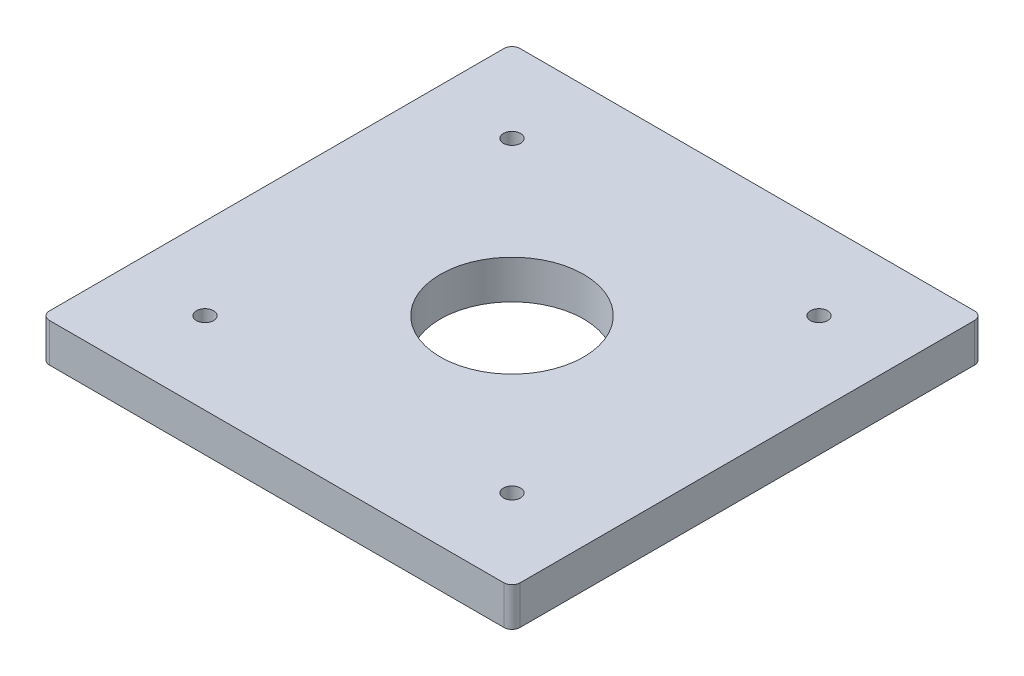
ISO-10303-21;
HEADER;
FILE_DESCRIPTION(('STEP AP214'),'2;1');
FILE_NAME('part.step','',(''),(''),'','','');
FILE_SCHEMA(('AUTOMOTIVE_DESIGN { 1 0 10303 214 1 1 1 1 }'));
ENDSEC;
DATA;
#1=APPLICATION_CONTEXT('core data for automotive mechanical design processes');
#2=APPLICATION_PROTOCOL_DEFINITION('international standard','automotive_design',2000,#1);
#3=PRODUCT_CONTEXT('',#1,'mechanical');
#4=PRODUCT('Part','Part','',(#3));
#5=PRODUCT_RELATED_PRODUCT_CATEGORY('part','',(#4));
#6=PRODUCT_DEFINITION_FORMATION('','',#4);
#7=PRODUCT_DEFINITION_CONTEXT('part definition',#1,'design');
#8=PRODUCT_DEFINITION('design','',#6,#7);
#9=PRODUCT_DEFINITION_SHAPE('','',#8);
#10=(LENGTH_UNIT() NAMED_UNIT(*) SI_UNIT(.MILLI.,.METRE.));
#11=(NAMED_UNIT(*) PLANE_ANGLE_UNIT() SI_UNIT($,.RADIAN.));
#12=(NAMED_UNIT(*) SI_UNIT($,.STERADIAN.) SOLID_ANGLE_UNIT());
#13=UNCERTAINTY_MEASURE_WITH_UNIT(LENGTH_MEASURE(1.E-05),#10,'distance_accuracy_value','');
#14=(GEOMETRIC_REPRESENTATION_CONTEXT(3) GLOBAL_UNCERTAINTY_ASSIGNED_CONTEXT((#13)) GLOBAL_UNIT_ASSIGNED_CONTEXT((#10,
#11,#12)) REPRESENTATION_CONTEXT('',''));
#15=CARTESIAN_POINT('',(0.,0.,0.));
#16=DIRECTION('',(0.,0.,1.));
#17=DIRECTION('',(1.,0.,0.));
#18=AXIS2_PLACEMENT_3D('',#15,#16,#17);
#19=CARTESIAN_POINT('',(0.,0.,0.));
#20=DIRECTION('',(0.,1.,0.));
#21=DIRECTION('',(0.,0.,1.));
#22=AXIS2_PLACEMENT_3D('',#19,#20,#21);
#23=PLANE('',#22);
#24=CARTESIAN_POINT('',(-47.625,0.,47.6249999999999));
#25=DIRECTION('',(0.,1.,0.));
#26=DIRECTION('',(0.,0.,1.));
#27=AXIS2_PLACEMENT_3D('',#24,#25,#26);
#28=CIRCLE('',#27,2.667);
#29=CARTESIAN_POINT('',(-47.625,0.,50.2919999999999));
#30=VERTEX_POINT('',#29);
#31=EDGE_CURVE('E144',#30,#30,#28,.T.);
#32=ORIENTED_EDGE('',*,*,#31,.T.);
#33=EDGE_LOOP('',(#32));
#34=FACE_BOUND('',#33,.T.);
#35=CARTESIAN_POINT('',(47.6249999999999,0.,-47.6250000000001));
#36=DIRECTION('',(0.,1.,0.));
#37=DIRECTION('',(0.,0.,1.));
#38=AXIS2_PLACEMENT_3D('',#35,#36,#37);
#39=CIRCLE('',#38,2.667);
#40=CARTESIAN_POINT('',(47.6249999999999,0.,-44.9580000000001));
#41=VERTEX_POINT('',#40);
#42=EDGE_CURVE('E147',#41,#41,#39,.T.);
#43=ORIENTED_EDGE('',*,*,#42,.T.);
#44=EDGE_LOOP('',(#43));
#45=FACE_BOUND('',#44,.T.);
#46=CARTESIAN_POINT('',(0.,0.,0.));
#47=DIRECTION('',(0.,-1.,0.));
#48=DIRECTION('',(0.,0.,-1.));
#49=AXIS2_PLACEMENT_3D('',#46,#47,#48);
#50=CIRCLE('',#49,22.225);
#51=CARTESIAN_POINT('',(0.,0.,-22.225));
#52=VERTEX_POINT('',#51);
#53=EDGE_CURVE('E150',#52,#52,#50,.F.);
#54=ORIENTED_EDGE('',*,*,#53,.T.);
#55=EDGE_LOOP('',(#54));
#56=FACE_BOUND('',#55,.T.);
#57=CARTESIAN_POINT('',(-70.485,0.,-70.485));
#58=DIRECTION('',(0.,-1.,0.));
#59=DIRECTION('',(0.,0.,-1.));
#60=AXIS2_PLACEMENT_3D('',#57,#58,#59);
#61=CIRCLE('',#60,2.54);
#62=CARTESIAN_POINT('',(-70.485,0.,-73.025));
#63=VERTEX_POINT('',#62);
#64=CARTESIAN_POINT('',(-73.025,0.,-70.485));
#65=VERTEX_POINT('',#64);
#66=EDGE_CURVE('E85',#63,#65,#61,.F.);
#67=ORIENTED_EDGE('',*,*,#66,.F.);
#68=DIRECTION('',(1.,0.,0.));
#69=VECTOR('',#68,1.);
#70=CARTESIAN_POINT('',(73.025,0.,-73.025));
#71=LINE('',#70,#69);
#72=CARTESIAN_POINT('',(70.485,0.,-73.025));
#73=VERTEX_POINT('',#72);
#74=EDGE_CURVE('E77',#63,#73,#71,.T.);
#75=ORIENTED_EDGE('',*,*,#74,.T.);
#76=CARTESIAN_POINT('',(70.485,0.,-70.485));
#77=DIRECTION('',(0.,-1.,0.));
#78=DIRECTION('',(0.,0.,-1.));
#79=AXIS2_PLACEMENT_3D('',#76,#77,#78);
#80=CIRCLE('',#79,2.54);
#81=CARTESIAN_POINT('',(73.025,0.,-70.485));
#82=VERTEX_POINT('',#81);
#83=EDGE_CURVE('E154',#82,#73,#80,.F.);
#84=ORIENTED_EDGE('',*,*,#83,.F.);
#85=DIRECTION('',(0.,0.,1.));
#86=VECTOR('',#85,1.);
#87=CARTESIAN_POINT('',(73.025,0.,73.025));
#88=LINE('',#87,#86);
#89=CARTESIAN_POINT('',(73.025,0.,70.485));
#90=VERTEX_POINT('',#89);
#91=EDGE_CURVE('E112',#82,#90,#88,.T.);
#92=ORIENTED_EDGE('',*,*,#91,.T.);
#93=CARTESIAN_POINT('',(70.485,0.,70.485));
#94=DIRECTION('',(0.,-1.,0.));
#95=DIRECTION('',(0.,0.,-1.));
#96=AXIS2_PLACEMENT_3D('',#93,#94,#95);
#97=CIRCLE('',#96,2.54);
#98=CARTESIAN_POINT('',(70.485,0.,73.025));
#99=VERTEX_POINT('',#98);
#100=EDGE_CURVE('E157',#99,#90,#97,.F.);
#101=ORIENTED_EDGE('',*,*,#100,.F.);
#102=DIRECTION('',(-1.,0.,0.));
#103=VECTOR('',#102,1.);
#104=CARTESIAN_POINT('',(73.025,0.,73.025));
#105=LINE('',#104,#103);
#106=CARTESIAN_POINT('',(-70.485,0.,73.025));
#107=VERTEX_POINT('',#106);
#108=EDGE_CURVE('E116',#99,#107,#105,.T.);
#109=ORIENTED_EDGE('',*,*,#108,.T.);
#110=CARTESIAN_POINT('',(-70.485,0.,70.485));
#111=DIRECTION('',(0.,-1.,0.));
#112=DIRECTION('',(0.,0.,-1.));
#113=AXIS2_PLACEMENT_3D('',#110,#111,#112);
#114=CIRCLE('',#113,2.54);
#115=CARTESIAN_POINT('',(-73.025,0.,70.485));
#116=VERTEX_POINT('',#115);
#117=EDGE_CURVE('E88',#116,#107,#114,.F.);
#118=ORIENTED_EDGE('',*,*,#117,.F.);
#119=DIRECTION('',(0.,0.,-1.));
#120=VECTOR('',#119,1.);
#121=CARTESIAN_POINT('',(-73.025,0.,73.025));
#122=LINE('',#121,#120);
#123=EDGE_CURVE('E82',#116,#65,#122,.T.);
#124=ORIENTED_EDGE('',*,*,#123,.T.);
#125=EDGE_LOOP('',(#67,#75,#84,#92,#101,#109,#118,#124));
#126=FACE_BOUND('',#125,.T.);
#127=CARTESIAN_POINT('',(-47.6250000000001,0.,-47.6250000000001));
#128=DIRECTION('',(0.,1.,0.));
#129=DIRECTION('',(0.,0.,1.));
#130=AXIS2_PLACEMENT_3D('',#127,#128,#129);
#131=CIRCLE('',#130,2.667);
#132=CARTESIAN_POINT('',(-47.6250000000001,0.,-44.9580000000001));
#133=VERTEX_POINT('',#132);
#134=EDGE_CURVE('E111',#133,#133,#131,.T.);
#135=ORIENTED_EDGE('',*,*,#134,.T.);
#136=EDGE_LOOP('',(#135));
#137=FACE_BOUND('',#136,.T.);
#138=CARTESIAN_POINT('',(47.625,0.,47.6249999999999));
#139=DIRECTION('',(0.,1.,0.));
#140=DIRECTION('',(0.,0.,1.));
#141=AXIS2_PLACEMENT_3D('',#138,#139,#140);
#142=CIRCLE('',#141,2.667);
#143=CARTESIAN_POINT('',(47.625,0.,50.2919999999999));
#144=VERTEX_POINT('',#143);
#145=EDGE_CURVE('E19',#144,#144,#142,.T.);
#146=ORIENTED_EDGE('',*,*,#145,.T.);
#147=EDGE_LOOP('',(#146));
#148=FACE_BOUND('',#147,.T.);
#149=ADVANCED_FACE('F16',(#34,#45,#56,#126,#137,#148),#23,.F.);
#150=CARTESIAN_POINT('',(47.625,0.,47.6249999999999));
#151=DIRECTION('',(0.,1.,0.));
#152=DIRECTION('',(0.,0.,1.));
#153=AXIS2_PLACEMENT_3D('',#150,#151,#152);
#154=CYLINDRICAL_SURFACE('',#153,2.667);
#155=ORIENTED_EDGE('',*,*,#145,.F.);
#156=EDGE_LOOP('',(#155));
#157=FACE_BOUND('',#156,.T.);
#158=CARTESIAN_POINT('',(47.625,12.,47.6249999999999));
#159=DIRECTION('',(0.,1.,0.));
#160=DIRECTION('',(0.,0.,1.));
#161=AXIS2_PLACEMENT_3D('',#158,#159,#160);
#162=CIRCLE('',#161,2.667);
#163=CARTESIAN_POINT('',(47.625,12.,50.2919999999999));
#164=VERTEX_POINT('',#163);
#165=EDGE_CURVE('E141',#164,#164,#162,.F.);
#166=ORIENTED_EDGE('',*,*,#165,.F.);
#167=EDGE_LOOP('',(#166));
#168=FACE_BOUND('',#167,.T.);
#169=ADVANCED_FACE('F166',(#157,#168),#154,.F.);
#170=CARTESIAN_POINT('',(-47.6250000000001,0.,-47.6250000000001));
#171=DIRECTION('',(0.,1.,0.));
#172=DIRECTION('',(0.,0.,1.));
#173=AXIS2_PLACEMENT_3D('',#170,#171,#172);
#174=CYLINDRICAL_SURFACE('',#173,2.667);
#175=ORIENTED_EDGE('',*,*,#134,.F.);
#176=EDGE_LOOP('',(#175));
#177=FACE_BOUND('',#176,.T.);
#178=CARTESIAN_POINT('',(-47.6250000000001,12.,-47.6250000000001));
#179=DIRECTION('',(0.,1.,0.));
#180=DIRECTION('',(0.,0.,1.));
#181=AXIS2_PLACEMENT_3D('',#178,#179,#180);
#182=CIRCLE('',#181,2.667);
#183=CARTESIAN_POINT('',(-47.6250000000001,12.,-44.9580000000001));
#184=VERTEX_POINT('',#183);
#185=EDGE_CURVE('E138',#184,#184,#182,.F.);
#186=ORIENTED_EDGE('',*,*,#185,.F.);
#187=EDGE_LOOP('',(#186));
#188=FACE_BOUND('',#187,.T.);
#189=ADVANCED_FACE('F169',(#177,#188),#174,.F.);
#190=CARTESIAN_POINT('',(73.025,12.,-73.025));
#191=DIRECTION('',(0.,0.,1.));
#192=DIRECTION('',(1.,0.,0.));
#193=AXIS2_PLACEMENT_3D('',#190,#191,#192);
#194=PLANE('',#193);
#195=DIRECTION('',(0.,-1.,0.));
#196=VECTOR('',#195,1.);
#197=CARTESIAN_POINT('',(-70.485,12.,-73.025));
#198=LINE('',#197,#196);
#199=CARTESIAN_POINT('',(-70.485,12.,-73.025));
#200=VERTEX_POINT('',#199);
#201=EDGE_CURVE('E98',#200,#63,#198,.T.);
#202=ORIENTED_EDGE('',*,*,#201,.F.);
#203=DIRECTION('',(1.,0.,0.));
#204=VECTOR('',#203,1.);
#205=CARTESIAN_POINT('',(0.,12.,-73.025));
#206=LINE('',#205,#204);
#207=CARTESIAN_POINT('',(70.485,12.,-73.025));
#208=VERTEX_POINT('',#207);
#209=EDGE_CURVE('E137',#208,#200,#206,.F.);
#210=ORIENTED_EDGE('',*,*,#209,.F.);
#211=DIRECTION('',(0.,-1.,0.));
#212=VECTOR('',#211,1.);
#213=CARTESIAN_POINT('',(70.485,12.,-73.025));
#214=LINE('',#213,#212);
#215=EDGE_CURVE('E153',#73,#208,#214,.F.);
#216=ORIENTED_EDGE('',*,*,#215,.F.);
#217=ORIENTED_EDGE('',*,*,#74,.F.);
#218=EDGE_LOOP('',(#202,#210,#216,#217));
#219=FACE_BOUND('',#218,.T.);
#220=ADVANCED_FACE('F216',(#219),#194,.F.);
#221=CARTESIAN_POINT('',(-70.485,12.,-70.485));
#222=DIRECTION('',(0.,-1.,0.));
#223=DIRECTION('',(0.,0.,-1.));
#224=AXIS2_PLACEMENT_3D('',#221,#222,#223);
#225=CYLINDRICAL_SURFACE('',#224,2.54);
#226=ORIENTED_EDGE('',*,*,#66,.T.);
#227=DIRECTION('',(0.,1.,0.));
#228=VECTOR('',#227,1.);
#229=CARTESIAN_POINT('',(-73.025,12.,-70.485));
#230=LINE('',#229,#228);
#231=CARTESIAN_POINT('',(-73.025,12.,-70.485));
#232=VERTEX_POINT('',#231);
#233=EDGE_CURVE('E92',#65,#232,#230,.T.);
#234=ORIENTED_EDGE('',*,*,#233,.T.);
#235=CARTESIAN_POINT('',(-70.485,12.,-70.485));
#236=DIRECTION('',(0.,-1.,0.));
#237=DIRECTION('',(0.,0.,-1.));
#238=AXIS2_PLACEMENT_3D('',#235,#236,#237);
#239=CIRCLE('',#238,2.54);
#240=EDGE_CURVE('E135',#200,#232,#239,.F.);
#241=ORIENTED_EDGE('',*,*,#240,.F.);
#242=ORIENTED_EDGE('',*,*,#201,.T.);
#243=EDGE_LOOP('',(#226,#234,#241,#242));
#244=FACE_BOUND('',#243,.T.);
#245=ADVANCED_FACE('F95',(#244),#225,.T.);
#246=CARTESIAN_POINT('',(-73.025,12.,73.025));
#247=DIRECTION('',(1.,0.,0.));
#248=DIRECTION('',(0.,0.,-1.));
#249=AXIS2_PLACEMENT_3D('',#246,#247,#248);
#250=PLANE('',#249);
#251=ORIENTED_EDGE('',*,*,#233,.F.);
#252=ORIENTED_EDGE('',*,*,#123,.F.);
#253=DIRECTION('',(0.,-1.,0.));
#254=VECTOR('',#253,1.);
#255=CARTESIAN_POINT('',(-73.025,12.,70.485));
#256=LINE('',#255,#254);
#257=CARTESIAN_POINT('',(-73.025,12.,70.485));
#258=VERTEX_POINT('',#257);
#259=EDGE_CURVE('E104',#258,#116,#256,.T.);
#260=ORIENTED_EDGE('',*,*,#259,.F.);
#261=DIRECTION('',(0.,0.,1.));
#262=VECTOR('',#261,1.);
#263=CARTESIAN_POINT('',(-73.025,12.,0.));
#264=LINE('',#263,#262);
#265=EDGE_CURVE('E102',#232,#258,#264,.T.);
#266=ORIENTED_EDGE('',*,*,#265,.F.);
#267=EDGE_LOOP('',(#251,#252,#260,#266));
#268=FACE_BOUND('',#267,.T.);
#269=ADVANCED_FACE('F100',(#268),#250,.F.);
#270=CARTESIAN_POINT('',(-70.485,12.,70.485));
#271=DIRECTION('',(0.,-1.,0.));
#272=DIRECTION('',(0.,0.,-1.));
#273=AXIS2_PLACEMENT_3D('',#270,#271,#272);
#274=CYLINDRICAL_SURFACE('',#273,2.54);
#275=ORIENTED_EDGE('',*,*,#117,.T.);
#276=DIRECTION('',(0.,1.,0.));
#277=VECTOR('',#276,1.);
#278=CARTESIAN_POINT('',(-70.485,12.,73.025));
#279=LINE('',#278,#277);
#280=CARTESIAN_POINT('',(-70.485,12.,73.025));
#281=VERTEX_POINT('',#280);
#282=EDGE_CURVE('E117',#107,#281,#279,.T.);
#283=ORIENTED_EDGE('',*,*,#282,.T.);
#284=CARTESIAN_POINT('',(-70.485,12.,70.485));
#285=DIRECTION('',(0.,-1.,0.));
#286=DIRECTION('',(0.,0.,-1.));
#287=AXIS2_PLACEMENT_3D('',#284,#285,#286);
#288=CIRCLE('',#287,2.54);
#289=EDGE_CURVE('E132',#258,#281,#288,.F.);
#290=ORIENTED_EDGE('',*,*,#289,.F.);
#291=ORIENTED_EDGE('',*,*,#259,.T.);
#292=EDGE_LOOP('',(#275,#283,#290,#291));
#293=FACE_BOUND('',#292,.T.);
#294=ADVANCED_FACE('F207',(#293),#274,.T.);
#295=CARTESIAN_POINT('',(73.025,12.,73.025));
#296=DIRECTION('',(0.,0.,-1.));
#297=DIRECTION('',(-1.,0.,0.));
#298=AXIS2_PLACEMENT_3D('',#295,#296,#297);
#299=PLANE('',#298);
#300=ORIENTED_EDGE('',*,*,#282,.F.);
#301=ORIENTED_EDGE('',*,*,#108,.F.);
#302=DIRECTION('',(0.,-1.,0.));
#303=VECTOR('',#302,1.);
#304=CARTESIAN_POINT('',(70.485,12.,73.025));
#305=LINE('',#304,#303);
#306=CARTESIAN_POINT('',(70.485,12.,73.025));
#307=VERTEX_POINT('',#306);
#308=EDGE_CURVE('E159',#307,#99,#305,.T.);
#309=ORIENTED_EDGE('',*,*,#308,.F.);
#310=DIRECTION('',(1.,0.,0.));
#311=VECTOR('',#310,1.);
#312=CARTESIAN_POINT('',(0.,12.,73.025));
#313=LINE('',#312,#311);
#314=EDGE_CURVE('E131',#281,#307,#313,.T.);
#315=ORIENTED_EDGE('',*,*,#314,.F.);
#316=EDGE_LOOP('',(#300,#301,#309,#315));
#317=FACE_BOUND('',#316,.T.);
#318=ADVANCED_FACE('F203',(#317),#299,.F.);
#319=CARTESIAN_POINT('',(70.485,12.,70.485));
#320=DIRECTION('',(0.,-1.,0.));
#321=DIRECTION('',(0.,0.,-1.));
#322=AXIS2_PLACEMENT_3D('',#319,#320,#321);
#323=CYLINDRICAL_SURFACE('',#322,2.54);
#324=ORIENTED_EDGE('',*,*,#100,.T.);
#325=DIRECTION('',(0.,1.,0.));
#326=VECTOR('',#325,1.);
#327=CARTESIAN_POINT('',(73.025,12.,70.485));
#328=LINE('',#327,#326);
#329=CARTESIAN_POINT('',(73.025,12.,70.485));
#330=VERTEX_POINT('',#329);
#331=EDGE_CURVE('E115',#90,#330,#328,.T.);
#332=ORIENTED_EDGE('',*,*,#331,.T.);
#333=CARTESIAN_POINT('',(70.485,12.,70.485));
#334=DIRECTION('',(0.,-1.,0.));
#335=DIRECTION('',(0.,0.,-1.));
#336=AXIS2_PLACEMENT_3D('',#333,#334,#335);
#337=CIRCLE('',#336,2.54);
#338=EDGE_CURVE('E128',#307,#330,#337,.F.);
#339=ORIENTED_EDGE('',*,*,#338,.F.);
#340=ORIENTED_EDGE('',*,*,#308,.T.);
#341=EDGE_LOOP('',(#324,#332,#339,#340));
#342=FACE_BOUND('',#341,.T.);
#343=ADVANCED_FACE('F200',(#342),#323,.T.);
#344=CARTESIAN_POINT('',(73.025,12.,73.025));
#345=DIRECTION('',(-1.,0.,0.));
#346=DIRECTION('',(0.,0.,1.));
#347=AXIS2_PLACEMENT_3D('',#344,#345,#346);
#348=PLANE('',#347);
#349=DIRECTION('',(0.,-1.,0.));
#350=VECTOR('',#349,1.);
#351=CARTESIAN_POINT('',(73.025,12.,-70.485));
#352=LINE('',#351,#350);
#353=CARTESIAN_POINT('',(73.025,12.,-70.485));
#354=VERTEX_POINT('',#353);
#355=EDGE_CURVE('E34',#354,#82,#352,.T.);
#356=ORIENTED_EDGE('',*,*,#355,.F.);
#357=DIRECTION('',(0.,0.,1.));
#358=VECTOR('',#357,1.);
#359=CARTESIAN_POINT('',(73.025,12.,0.));
#360=LINE('',#359,#358);
#361=EDGE_CURVE('E127',#330,#354,#360,.F.);
#362=ORIENTED_EDGE('',*,*,#361,.F.);
#363=ORIENTED_EDGE('',*,*,#331,.F.);
#364=ORIENTED_EDGE('',*,*,#91,.F.);
#365=EDGE_LOOP('',(#356,#362,#363,#364));
#366=FACE_BOUND('',#365,.T.);
#367=ADVANCED_FACE('F196',(#366),#348,.F.);
#368=CARTESIAN_POINT('',(70.485,12.,-70.485));
#369=DIRECTION('',(0.,-1.,0.));
#370=DIRECTION('',(0.,0.,-1.));
#371=AXIS2_PLACEMENT_3D('',#368,#369,#370);
#372=CYLINDRICAL_SURFACE('',#371,2.54);
#373=ORIENTED_EDGE('',*,*,#83,.T.);
#374=ORIENTED_EDGE('',*,*,#215,.T.);
#375=CARTESIAN_POINT('',(70.485,12.,-70.485));
#376=DIRECTION('',(0.,-1.,0.));
#377=DIRECTION('',(0.,0.,-1.));
#378=AXIS2_PLACEMENT_3D('',#375,#376,#377);
#379=CIRCLE('',#378,2.54);
#380=EDGE_CURVE('E124',#354,#208,#379,.F.);
#381=ORIENTED_EDGE('',*,*,#380,.F.);
#382=ORIENTED_EDGE('',*,*,#355,.T.);
#383=EDGE_LOOP('',(#373,#374,#381,#382));
#384=FACE_BOUND('',#383,.T.);
#385=ADVANCED_FACE('F192',(#384),#372,.T.);
#386=CARTESIAN_POINT('',(0.,12.,0.));
#387=DIRECTION('',(0.,-1.,0.));
#388=DIRECTION('',(0.,0.,-1.));
#389=AXIS2_PLACEMENT_3D('',#386,#387,#388);
#390=CYLINDRICAL_SURFACE('',#389,22.225);
#391=CARTESIAN_POINT('',(0.,12.,0.));
#392=DIRECTION('',(0.,-1.,0.));
#393=DIRECTION('',(0.,0.,-1.));
#394=AXIS2_PLACEMENT_3D('',#391,#392,#393);
#395=CIRCLE('',#394,22.225);
#396=CARTESIAN_POINT('',(0.,12.,-22.225));
#397=VERTEX_POINT('',#396);
#398=EDGE_CURVE('E121',#397,#397,#395,.T.);
#399=ORIENTED_EDGE('',*,*,#398,.F.);
#400=EDGE_LOOP('',(#399));
#401=FACE_BOUND('',#400,.T.);
#402=ORIENTED_EDGE('',*,*,#53,.F.);
#403=EDGE_LOOP('',(#402));
#404=FACE_BOUND('',#403,.T.);
#405=ADVANCED_FACE('F188',(#401,#404),#390,.F.);
#406=CARTESIAN_POINT('',(47.6249999999999,0.,-47.6250000000001));
#407=DIRECTION('',(0.,1.,0.));
#408=DIRECTION('',(0.,0.,1.));
#409=AXIS2_PLACEMENT_3D('',#406,#407,#408);
#410=CYLINDRICAL_SURFACE('',#409,2.667);
#411=ORIENTED_EDGE('',*,*,#42,.F.);
#412=EDGE_LOOP('',(#411));
#413=FACE_BOUND('',#412,.T.);
#414=CARTESIAN_POINT('',(47.6249999999999,12.,-47.6250000000001));
#415=DIRECTION('',(0.,1.,0.));
#416=DIRECTION('',(0.,0.,1.));
#417=AXIS2_PLACEMENT_3D('',#414,#415,#416);
#418=CIRCLE('',#417,2.667);
#419=CARTESIAN_POINT('',(47.6249999999999,12.,-44.9580000000001));
#420=VERTEX_POINT('',#419);
#421=EDGE_CURVE('E25',#420,#420,#418,.F.);
#422=ORIENTED_EDGE('',*,*,#421,.F.);
#423=EDGE_LOOP('',(#422));
#424=FACE_BOUND('',#423,.T.);
#425=ADVANCED_FACE('F181',(#413,#424),#410,.F.);
#426=CARTESIAN_POINT('',(-47.625,0.,47.6249999999999));
#427=DIRECTION('',(0.,1.,0.));
#428=DIRECTION('',(0.,0.,1.));
#429=AXIS2_PLACEMENT_3D('',#426,#427,#428);
#430=CYLINDRICAL_SURFACE('',#429,2.667);
#431=ORIENTED_EDGE('',*,*,#31,.F.);
#432=EDGE_LOOP('',(#431));
#433=FACE_BOUND('',#432,.T.);
#434=CARTESIAN_POINT('',(-47.625,12.,47.6249999999999));
#435=DIRECTION('',(0.,1.,0.));
#436=DIRECTION('',(0.,0.,1.));
#437=AXIS2_PLACEMENT_3D('',#434,#435,#436);
#438=CIRCLE('',#437,2.667);
#439=CARTESIAN_POINT('',(-47.625,12.,50.2919999999999));
#440=VERTEX_POINT('',#439);
#441=EDGE_CURVE('E11',#440,#440,#438,.F.);
#442=ORIENTED_EDGE('',*,*,#441,.F.);
#443=EDGE_LOOP('',(#442));
#444=FACE_BOUND('',#443,.T.);
#445=ADVANCED_FACE('F174',(#433,#444),#430,.F.);
#446=CARTESIAN_POINT('',(0.,12.,0.));
#447=DIRECTION('',(0.,1.,0.));
#448=DIRECTION('',(0.,0.,1.));
#449=AXIS2_PLACEMENT_3D('',#446,#447,#448);
#450=PLANE('',#449);
#451=ORIENTED_EDGE('',*,*,#441,.T.);
#452=EDGE_LOOP('',(#451));
#453=FACE_BOUND('',#452,.T.);
#454=ORIENTED_EDGE('',*,*,#421,.T.);
#455=EDGE_LOOP('',(#454));
#456=FACE_BOUND('',#455,.T.);
#457=ORIENTED_EDGE('',*,*,#398,.T.);
#458=EDGE_LOOP('',(#457));
#459=FACE_BOUND('',#458,.T.);
#460=ORIENTED_EDGE('',*,*,#361,.T.);
#461=ORIENTED_EDGE('',*,*,#380,.T.);
#462=ORIENTED_EDGE('',*,*,#209,.T.);
#463=ORIENTED_EDGE('',*,*,#240,.T.);
#464=ORIENTED_EDGE('',*,*,#265,.T.);
#465=ORIENTED_EDGE('',*,*,#289,.T.);
#466=ORIENTED_EDGE('',*,*,#314,.T.);
#467=ORIENTED_EDGE('',*,*,#338,.T.);
#468=EDGE_LOOP('',(#460,#461,#462,#463,#464,#465,#466,#467));
#469=FACE_BOUND('',#468,.T.);
#470=ORIENTED_EDGE('',*,*,#185,.T.);
#471=EDGE_LOOP('',(#470));
#472=FACE_BOUND('',#471,.T.);
#473=ORIENTED_EDGE('',*,*,#165,.T.);
#474=EDGE_LOOP('',(#473));
#475=FACE_BOUND('',#474,.T.);
#476=ADVANCED_FACE('F172',(#453,#456,#459,#469,#472,#475),#450,.T.);
#477=CLOSED_SHELL('',(#149,#169,#189,#220,#245,#269,#294,#318,#343,#367,#385,#405,#425,#445,#476));
#478=MANIFOLD_SOLID_BREP('B1',#477);
#479=ADVANCED_BREP_SHAPE_REPRESENTATION('',(#18,#478),#14);
#480=SHAPE_DEFINITION_REPRESENTATION(#9,#479);
ENDSEC;
END-ISO-10303-21;
